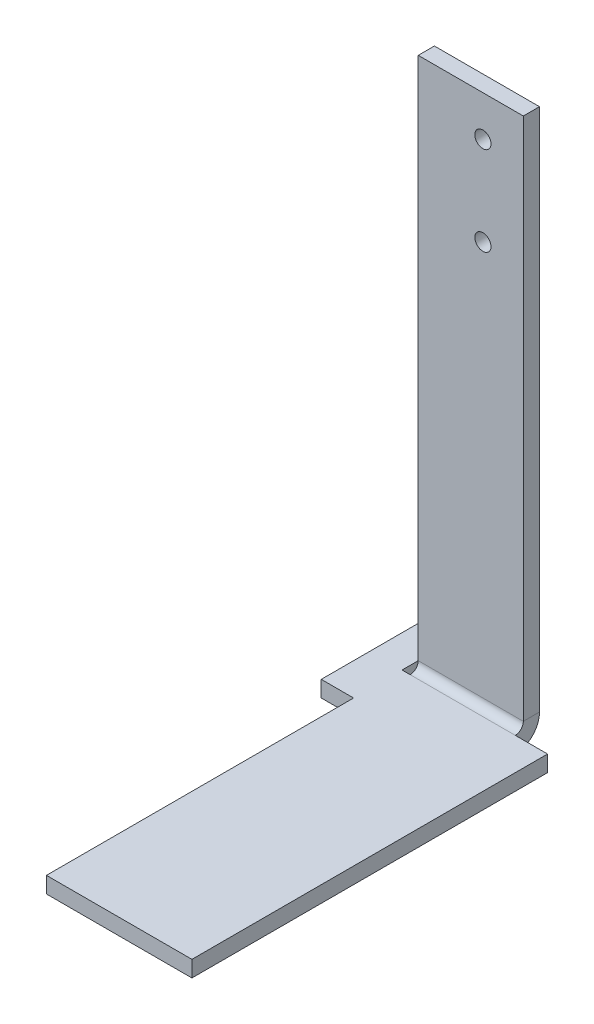
ISO-10303-21;
HEADER;
FILE_DESCRIPTION(('STEP AP214'),'2;1');
FILE_NAME('part.step','',(''),(''),'','','');
FILE_SCHEMA(('AUTOMOTIVE_DESIGN { 1 0 10303 214 1 1 1 1 }'));
ENDSEC;
DATA;
#1=APPLICATION_CONTEXT('core data for automotive mechanical design processes');
#2=APPLICATION_PROTOCOL_DEFINITION('international standard','automotive_design',2000,#1);
#3=PRODUCT_CONTEXT('',#1,'mechanical');
#4=PRODUCT('Part','Part','',(#3));
#5=PRODUCT_RELATED_PRODUCT_CATEGORY('part','',(#4));
#6=PRODUCT_DEFINITION_FORMATION('','',#4);
#7=PRODUCT_DEFINITION_CONTEXT('part definition',#1,'design');
#8=PRODUCT_DEFINITION('design','',#6,#7);
#9=PRODUCT_DEFINITION_SHAPE('','',#8);
#10=(LENGTH_UNIT() NAMED_UNIT(*) SI_UNIT(.MILLI.,.METRE.));
#11=(NAMED_UNIT(*) PLANE_ANGLE_UNIT() SI_UNIT($,.RADIAN.));
#12=(NAMED_UNIT(*) SI_UNIT($,.STERADIAN.) SOLID_ANGLE_UNIT());
#13=UNCERTAINTY_MEASURE_WITH_UNIT(LENGTH_MEASURE(1.E-05),#10,'distance_accuracy_value','');
#14=(GEOMETRIC_REPRESENTATION_CONTEXT(3) GLOBAL_UNCERTAINTY_ASSIGNED_CONTEXT((#13)) GLOBAL_UNIT_ASSIGNED_CONTEXT((#10,
#11,#12)) REPRESENTATION_CONTEXT('',''));
#15=CARTESIAN_POINT('',(0.,0.,0.));
#16=DIRECTION('',(0.,0.,1.));
#17=DIRECTION('',(1.,0.,0.));
#18=AXIS2_PLACEMENT_3D('',#15,#16,#17);
#19=CARTESIAN_POINT('',(0.,-23.0707963267949,-23.5000000000001));
#20=DIRECTION('',(0.,0.,1.));
#21=DIRECTION('',(0.,-1.,0.));
#22=AXIS2_PLACEMENT_3D('',#19,#20,#21);
#23=PLANE('',#22);
#24=CARTESIAN_POINT('',(4.49999999999999,24.9292036732051,-23.4999999999999));
#25=DIRECTION('',(0.,0.,-1.));
#26=DIRECTION('',(0.,1.,0.));
#27=AXIS2_PLACEMENT_3D('',#24,#25,#26);
#28=CIRCLE('',#27,0.500000000000002);
#29=CARTESIAN_POINT('',(4.49999999999999,25.4292036732051,-23.4999999999999));
#30=VERTEX_POINT('',#29);
#31=EDGE_CURVE('E279',#30,#30,#28,.T.);
#32=ORIENTED_EDGE('',*,*,#31,.F.);
#33=EDGE_LOOP('',(#32));
#34=FACE_BOUND('',#33,.T.);
#35=CARTESIAN_POINT('',(4.49999999999999,30.4292036732051,-23.4999999999999));
#36=DIRECTION('',(0.,0.,-1.));
#37=DIRECTION('',(0.,1.,0.));
#38=AXIS2_PLACEMENT_3D('',#35,#36,#37);
#39=CIRCLE('',#38,0.500000000000002);
#40=CARTESIAN_POINT('',(4.49999999999999,30.9292036732051,-23.4999999999999));
#41=VERTEX_POINT('',#40);
#42=EDGE_CURVE('E202',#41,#41,#39,.T.);
#43=ORIENTED_EDGE('',*,*,#42,.F.);
#44=EDGE_LOOP('',(#43));
#45=FACE_BOUND('',#44,.T.);
#46=DIRECTION('',(0.,1.,0.));
#47=VECTOR('',#46,1.);
#48=CARTESIAN_POINT('',(7.,-1.07079632679489,-23.5));
#49=LINE('',#48,#47);
#50=CARTESIAN_POINT('',(7.,0.499999999999998,-23.5));
#51=VERTEX_POINT('',#50);
#52=CARTESIAN_POINT('',(7.,32.9292036732051,-23.4999999999999));
#53=VERTEX_POINT('',#52);
#54=EDGE_CURVE('E41',#51,#53,#49,.T.);
#55=ORIENTED_EDGE('',*,*,#54,.F.);
#56=DIRECTION('',(-1.,0.,0.));
#57=VECTOR('',#56,1.);
#58=CARTESIAN_POINT('',(0.,0.500000000000004,-23.5));
#59=LINE('',#58,#57);
#60=CARTESIAN_POINT('',(0.500000000000001,0.500000000000004,-23.5));
#61=VERTEX_POINT('',#60);
#62=EDGE_CURVE('E139',#51,#61,#59,.T.);
#63=ORIENTED_EDGE('',*,*,#62,.T.);
#64=DIRECTION('',(0.,-1.,0.));
#65=VECTOR('',#64,1.);
#66=CARTESIAN_POINT('',(0.5,4.92920367320513,-23.5));
#67=LINE('',#66,#65);
#68=CARTESIAN_POINT('',(0.5,32.9292036732051,-23.4999999999999));
#69=VERTEX_POINT('',#68);
#70=EDGE_CURVE('E169',#69,#61,#67,.T.);
#71=ORIENTED_EDGE('',*,*,#70,.F.);
#72=DIRECTION('',(-1.,0.,0.));
#73=VECTOR('',#72,1.);
#74=CARTESIAN_POINT('',(-2.,32.9292036732051,-23.4999999999999));
#75=LINE('',#74,#73);
#76=EDGE_CURVE('E159',#53,#69,#75,.T.);
#77=ORIENTED_EDGE('',*,*,#76,.F.);
#78=EDGE_LOOP('',(#55,#63,#71,#77));
#79=FACE_BOUND('',#78,.T.);
#80=ADVANCED_FACE('F37',(#34,#45,#79),#23,.F.);
#81=CARTESIAN_POINT('',(-2.,32.9292036732051,-23.4999999999999));
#82=DIRECTION('',(0.,1.,0.));
#83=DIRECTION('',(-1.,0.,0.));
#84=AXIS2_PLACEMENT_3D('',#81,#82,#83);
#85=PLANE('',#84);
#86=ORIENTED_EDGE('',*,*,#76,.T.);
#87=DIRECTION('',(0.,0.,1.));
#88=VECTOR('',#87,1.);
#89=CARTESIAN_POINT('',(0.5,32.9292036732051,-23.4999999999999));
#90=LINE('',#89,#88);
#91=CARTESIAN_POINT('',(0.5,32.9292036732051,-22.4999999999999));
#92=VERTEX_POINT('',#91);
#93=EDGE_CURVE('E171',#69,#92,#90,.T.);
#94=ORIENTED_EDGE('',*,*,#93,.T.);
#95=DIRECTION('',(-1.,0.,0.));
#96=VECTOR('',#95,1.);
#97=CARTESIAN_POINT('',(-2.,32.9292036732051,-22.4999999999999));
#98=LINE('',#97,#96);
#99=CARTESIAN_POINT('',(7.,32.9292036732051,-22.4999999999999));
#100=VERTEX_POINT('',#99);
#101=EDGE_CURVE('E160',#100,#92,#98,.T.);
#102=ORIENTED_EDGE('',*,*,#101,.F.);
#103=DIRECTION('',(0.,0.,1.));
#104=VECTOR('',#103,1.);
#105=CARTESIAN_POINT('',(7.,32.9292036732051,-23.4999999999999));
#106=LINE('',#105,#104);
#107=EDGE_CURVE('E148',#53,#100,#106,.T.);
#108=ORIENTED_EDGE('',*,*,#107,.F.);
#109=EDGE_LOOP('',(#86,#94,#102,#108));
#110=FACE_BOUND('',#109,.T.);
#111=ADVANCED_FACE('F186',(#110),#85,.T.);
#112=CARTESIAN_POINT('',(0.,-23.0707963267949,-22.5000000000001));
#113=DIRECTION('',(0.,0.,1.));
#114=DIRECTION('',(0.,-1.,0.));
#115=AXIS2_PLACEMENT_3D('',#112,#113,#114);
#116=PLANE('',#115);
#117=CARTESIAN_POINT('',(4.49999999999999,24.9292036732051,-22.4999999999999));
#118=DIRECTION('',(0.,0.,1.));
#119=DIRECTION('',(0.,-1.,0.));
#120=AXIS2_PLACEMENT_3D('',#117,#118,#119);
#121=CIRCLE('',#120,0.500000000000002);
#122=CARTESIAN_POINT('',(4.49999999999999,24.4292036732051,-22.4999999999999));
#123=VERTEX_POINT('',#122);
#124=EDGE_CURVE('E282',#123,#123,#121,.F.);
#125=ORIENTED_EDGE('',*,*,#124,.T.);
#126=EDGE_LOOP('',(#125));
#127=FACE_BOUND('',#126,.T.);
#128=CARTESIAN_POINT('',(4.49999999999999,30.4292036732051,-22.4999999999999));
#129=DIRECTION('',(0.,0.,1.));
#130=DIRECTION('',(0.,-1.,0.));
#131=AXIS2_PLACEMENT_3D('',#128,#129,#130);
#132=CIRCLE('',#131,0.500000000000002);
#133=CARTESIAN_POINT('',(4.49999999999999,29.9292036732051,-22.4999999999999));
#134=VERTEX_POINT('',#133);
#135=EDGE_CURVE('E276',#134,#134,#132,.F.);
#136=ORIENTED_EDGE('',*,*,#135,.T.);
#137=EDGE_LOOP('',(#136));
#138=FACE_BOUND('',#137,.T.);
#139=DIRECTION('',(-1.,0.,0.));
#140=VECTOR('',#139,1.);
#141=CARTESIAN_POINT('',(0.,0.5,-22.5));
#142=LINE('',#141,#140);
#143=CARTESIAN_POINT('',(7.,0.499999999999997,-22.5));
#144=VERTEX_POINT('',#143);
#145=CARTESIAN_POINT('',(0.5,0.499999999999997,-22.5));
#146=VERTEX_POINT('',#145);
#147=EDGE_CURVE('E46',#144,#146,#142,.T.);
#148=ORIENTED_EDGE('',*,*,#147,.F.);
#149=DIRECTION('',(0.,1.,0.));
#150=VECTOR('',#149,1.);
#151=CARTESIAN_POINT('',(7.,-1.07079632679489,-22.5));
#152=LINE('',#151,#150);
#153=EDGE_CURVE('E163',#144,#100,#152,.T.);
#154=ORIENTED_EDGE('',*,*,#153,.T.);
#155=ORIENTED_EDGE('',*,*,#101,.T.);
#156=DIRECTION('',(0.,-1.,0.));
#157=VECTOR('',#156,1.);
#158=CARTESIAN_POINT('',(0.5,4.92920367320513,-22.5));
#159=LINE('',#158,#157);
#160=EDGE_CURVE('E172',#92,#146,#159,.T.);
#161=ORIENTED_EDGE('',*,*,#160,.T.);
#162=EDGE_LOOP('',(#148,#154,#155,#161));
#163=FACE_BOUND('',#162,.T.);
#164=ADVANCED_FACE('F187',(#127,#138,#163),#116,.T.);
#165=CARTESIAN_POINT('',(7.,-1.07079632679489,-23.5));
#166=DIRECTION('',(1.,0.,0.));
#167=DIRECTION('',(0.,1.,0.));
#168=AXIS2_PLACEMENT_3D('',#165,#166,#167);
#169=PLANE('',#168);
#170=DIRECTION('',(0.,0.,1.));
#171=VECTOR('',#170,1.);
#172=CARTESIAN_POINT('',(7.,0.500000000000004,-23.5));
#173=LINE('',#172,#171);
#174=EDGE_CURVE('E147',#51,#144,#173,.T.);
#175=ORIENTED_EDGE('',*,*,#174,.F.);
#176=ORIENTED_EDGE('',*,*,#54,.T.);
#177=ORIENTED_EDGE('',*,*,#107,.T.);
#178=ORIENTED_EDGE('',*,*,#153,.F.);
#179=EDGE_LOOP('',(#175,#176,#177,#178));
#180=FACE_BOUND('',#179,.T.);
#181=ADVANCED_FACE('F162',(#180),#169,.T.);
#182=CARTESIAN_POINT('',(0.5,4.92920367320513,-23.5));
#183=DIRECTION('',(-1.,0.,0.));
#184=DIRECTION('',(0.,-1.,0.));
#185=AXIS2_PLACEMENT_3D('',#182,#183,#184);
#186=PLANE('',#185);
#187=DIRECTION('',(0.,0.,-1.));
#188=VECTOR('',#187,1.);
#189=CARTESIAN_POINT('',(0.500000000000001,0.500000000000004,-23.5));
#190=LINE('',#189,#188);
#191=EDGE_CURVE('E12',#146,#61,#190,.T.);
#192=ORIENTED_EDGE('',*,*,#191,.F.);
#193=ORIENTED_EDGE('',*,*,#160,.F.);
#194=ORIENTED_EDGE('',*,*,#93,.F.);
#195=ORIENTED_EDGE('',*,*,#70,.T.);
#196=EDGE_LOOP('',(#192,#193,#194,#195));
#197=FACE_BOUND('',#196,.T.);
#198=ADVANCED_FACE('F39',(#197),#186,.T.);
#199=CARTESIAN_POINT('',(0.,-1.,-28.));
#200=DIRECTION('',(1.,0.,0.));
#201=DIRECTION('',(0.,0.,-1.));
#202=AXIS2_PLACEMENT_3D('',#199,#200,#201);
#203=PLANE('',#202);
#204=DIRECTION('',(0.,0.,-1.));
#205=VECTOR('',#204,1.);
#206=CARTESIAN_POINT('',(0.,0.,-28.));
#207=LINE('',#206,#205);
#208=CARTESIAN_POINT('',(0.,0.,-22.));
#209=VERTEX_POINT('',#208);
#210=CARTESIAN_POINT('',(0.,0.,-26.5));
#211=VERTEX_POINT('',#210);
#212=EDGE_CURVE('E226',#209,#211,#207,.T.);
#213=ORIENTED_EDGE('',*,*,#212,.F.);
#214=DIRECTION('',(0.,1.,0.));
#215=VECTOR('',#214,1.);
#216=CARTESIAN_POINT('',(0.,-1.,-22.));
#217=LINE('',#216,#215);
#218=CARTESIAN_POINT('',(0.,-1.,-22.));
#219=VERTEX_POINT('',#218);
#220=EDGE_CURVE('E174',#219,#209,#217,.T.);
#221=ORIENTED_EDGE('',*,*,#220,.F.);
#222=DIRECTION('',(0.,0.,-1.));
#223=VECTOR('',#222,1.);
#224=CARTESIAN_POINT('',(0.,-1.,-28.));
#225=LINE('',#224,#223);
#226=CARTESIAN_POINT('',(0.,-1.,-26.5));
#227=VERTEX_POINT('',#226);
#228=EDGE_CURVE('E274',#219,#227,#225,.T.);
#229=ORIENTED_EDGE('',*,*,#228,.T.);
#230=DIRECTION('',(0.,1.,0.));
#231=VECTOR('',#230,1.);
#232=CARTESIAN_POINT('',(0.,-1.,-26.5));
#233=LINE('',#232,#231);
#234=EDGE_CURVE('E271',#227,#211,#233,.T.);
#235=ORIENTED_EDGE('',*,*,#234,.T.);
#236=EDGE_LOOP('',(#213,#221,#229,#235));
#237=FACE_BOUND('',#236,.T.);
#238=ADVANCED_FACE('F316',(#237),#203,.T.);
#239=CARTESIAN_POINT('',(-41.0315666589957,-1.,-26.5000000000001));
#240=DIRECTION('',(0.,0.,-1.));
#241=DIRECTION('',(-1.,0.,0.));
#242=AXIS2_PLACEMENT_3D('',#239,#240,#241);
#243=PLANE('',#242);
#244=DIRECTION('',(-1.,0.,0.));
#245=VECTOR('',#244,1.);
#246=CARTESIAN_POINT('',(-41.0315666589957,0.,-26.5000000000001));
#247=LINE('',#246,#245);
#248=CARTESIAN_POINT('',(-1.99999999999999,0.,-26.5));
#249=VERTEX_POINT('',#248);
#250=EDGE_CURVE('E223',#211,#249,#247,.T.);
#251=ORIENTED_EDGE('',*,*,#250,.F.);
#252=ORIENTED_EDGE('',*,*,#234,.F.);
#253=DIRECTION('',(-1.,0.,0.));
#254=VECTOR('',#253,1.);
#255=CARTESIAN_POINT('',(-41.0315666589957,-1.,-26.5000000000001));
#256=LINE('',#255,#254);
#257=CARTESIAN_POINT('',(-1.99999999999999,-1.,-26.5));
#258=VERTEX_POINT('',#257);
#259=EDGE_CURVE('E269',#227,#258,#256,.T.);
#260=ORIENTED_EDGE('',*,*,#259,.T.);
#261=DIRECTION('',(0.,1.,0.));
#262=VECTOR('',#261,1.);
#263=CARTESIAN_POINT('',(-1.99999999999999,-1.,-26.5));
#264=LINE('',#263,#262);
#265=EDGE_CURVE('E267',#258,#249,#264,.T.);
#266=ORIENTED_EDGE('',*,*,#265,.T.);
#267=EDGE_LOOP('',(#251,#252,#260,#266));
#268=FACE_BOUND('',#267,.T.);
#269=ADVANCED_FACE('F319',(#268),#243,.T.);
#270=CARTESIAN_POINT('',(-2.,-1.,-56.));
#271=DIRECTION('',(-1.,0.,0.));
#272=DIRECTION('',(0.,0.,1.));
#273=AXIS2_PLACEMENT_3D('',#270,#271,#272);
#274=PLANE('',#273);
#275=DIRECTION('',(0.,0.,1.));
#276=VECTOR('',#275,1.);
#277=CARTESIAN_POINT('',(-2.,0.,-56.));
#278=LINE('',#277,#276);
#279=CARTESIAN_POINT('',(-1.99999999999999,0.,-19.));
#280=VERTEX_POINT('',#279);
#281=EDGE_CURVE('E221',#249,#280,#278,.T.);
#282=ORIENTED_EDGE('',*,*,#281,.F.);
#283=ORIENTED_EDGE('',*,*,#265,.F.);
#284=DIRECTION('',(0.,0.,1.));
#285=VECTOR('',#284,1.);
#286=CARTESIAN_POINT('',(-2.,-1.,-56.));
#287=LINE('',#286,#285);
#288=CARTESIAN_POINT('',(-1.99999999999999,-1.,-19.));
#289=VERTEX_POINT('',#288);
#290=EDGE_CURVE('E265',#258,#289,#287,.T.);
#291=ORIENTED_EDGE('',*,*,#290,.T.);
#292=DIRECTION('',(0.,1.,0.));
#293=VECTOR('',#292,1.);
#294=CARTESIAN_POINT('',(-1.99999999999999,-1.,-19.));
#295=LINE('',#294,#293);
#296=EDGE_CURVE('E262',#289,#280,#295,.T.);
#297=ORIENTED_EDGE('',*,*,#296,.T.);
#298=EDGE_LOOP('',(#282,#283,#291,#297));
#299=FACE_BOUND('',#298,.T.);
#300=ADVANCED_FACE('F323',(#299),#274,.T.);
#301=CARTESIAN_POINT('',(-1.99999999999999,-1.,-19.));
#302=DIRECTION('',(0.,0.,1.));
#303=DIRECTION('',(1.,0.,0.));
#304=AXIS2_PLACEMENT_3D('',#301,#302,#303);
#305=PLANE('',#304);
#306=DIRECTION('',(1.,0.,0.));
#307=VECTOR('',#306,1.);
#308=CARTESIAN_POINT('',(-1.99999999999999,0.,-19.));
#309=LINE('',#308,#307);
#310=CARTESIAN_POINT('',(0.,0.,-19.));
#311=VERTEX_POINT('',#310);
#312=EDGE_CURVE('E218',#280,#311,#309,.T.);
#313=ORIENTED_EDGE('',*,*,#312,.F.);
#314=ORIENTED_EDGE('',*,*,#296,.F.);
#315=DIRECTION('',(1.,0.,0.));
#316=VECTOR('',#315,1.);
#317=CARTESIAN_POINT('',(-1.99999999999999,-1.,-19.));
#318=LINE('',#317,#316);
#319=CARTESIAN_POINT('',(0.,-1.,-19.));
#320=VERTEX_POINT('',#319);
#321=EDGE_CURVE('E259',#289,#320,#318,.T.);
#322=ORIENTED_EDGE('',*,*,#321,.T.);
#323=DIRECTION('',(0.,1.,0.));
#324=VECTOR('',#323,1.);
#325=CARTESIAN_POINT('',(0.,-1.,-19.));
#326=LINE('',#325,#324);
#327=EDGE_CURVE('E257',#320,#311,#326,.T.);
#328=ORIENTED_EDGE('',*,*,#327,.T.);
#329=EDGE_LOOP('',(#313,#314,#322,#328));
#330=FACE_BOUND('',#329,.T.);
#331=ADVANCED_FACE('F327',(#330),#305,.T.);
#332=CARTESIAN_POINT('',(0.,-1.,-19.));
#333=DIRECTION('',(-1.,0.,0.));
#334=DIRECTION('',(0.,0.,1.));
#335=AXIS2_PLACEMENT_3D('',#332,#333,#334);
#336=PLANE('',#335);
#337=DIRECTION('',(0.,0.,1.));
#338=VECTOR('',#337,1.);
#339=CARTESIAN_POINT('',(0.,0.,-19.));
#340=LINE('',#339,#338);
#341=CARTESIAN_POINT('',(0.,0.,0.));
#342=VERTEX_POINT('',#341);
#343=EDGE_CURVE('E215',#311,#342,#340,.T.);
#344=ORIENTED_EDGE('',*,*,#343,.F.);
#345=ORIENTED_EDGE('',*,*,#327,.F.);
#346=DIRECTION('',(0.,0.,1.));
#347=VECTOR('',#346,1.);
#348=CARTESIAN_POINT('',(0.,-1.,-19.));
#349=LINE('',#348,#347);
#350=CARTESIAN_POINT('',(0.,-1.,0.));
#351=VERTEX_POINT('',#350);
#352=EDGE_CURVE('E254',#320,#351,#349,.T.);
#353=ORIENTED_EDGE('',*,*,#352,.T.);
#354=DIRECTION('',(0.,1.,0.));
#355=VECTOR('',#354,1.);
#356=CARTESIAN_POINT('',(0.,-1.,0.));
#357=LINE('',#356,#355);
#358=EDGE_CURVE('E252',#351,#342,#357,.T.);
#359=ORIENTED_EDGE('',*,*,#358,.T.);
#360=EDGE_LOOP('',(#344,#345,#353,#359));
#361=FACE_BOUND('',#360,.T.);
#362=ADVANCED_FACE('F331',(#361),#336,.T.);
#363=CARTESIAN_POINT('',(0.,-1.,0.));
#364=DIRECTION('',(0.,0.,1.));
#365=DIRECTION('',(1.,0.,0.));
#366=AXIS2_PLACEMENT_3D('',#363,#364,#365);
#367=PLANE('',#366);
#368=DIRECTION('',(1.,0.,0.));
#369=VECTOR('',#368,1.);
#370=CARTESIAN_POINT('',(0.,0.,0.));
#371=LINE('',#370,#369);
#372=CARTESIAN_POINT('',(9.,0.,0.));
#373=VERTEX_POINT('',#372);
#374=EDGE_CURVE('E212',#342,#373,#371,.T.);
#375=ORIENTED_EDGE('',*,*,#374,.F.);
#376=ORIENTED_EDGE('',*,*,#358,.F.);
#377=DIRECTION('',(1.,0.,0.));
#378=VECTOR('',#377,1.);
#379=CARTESIAN_POINT('',(0.,-1.,0.));
#380=LINE('',#379,#378);
#381=CARTESIAN_POINT('',(9.,-1.,0.));
#382=VERTEX_POINT('',#381);
#383=EDGE_CURVE('E249',#351,#382,#380,.T.);
#384=ORIENTED_EDGE('',*,*,#383,.T.);
#385=DIRECTION('',(0.,1.,0.));
#386=VECTOR('',#385,1.);
#387=CARTESIAN_POINT('',(9.,-1.,0.));
#388=LINE('',#387,#386);
#389=EDGE_CURVE('E247',#382,#373,#388,.T.);
#390=ORIENTED_EDGE('',*,*,#389,.T.);
#391=EDGE_LOOP('',(#375,#376,#384,#390));
#392=FACE_BOUND('',#391,.T.);
#393=ADVANCED_FACE('F335',(#392),#367,.T.);
#394=CARTESIAN_POINT('',(9.,-1.,0.));
#395=DIRECTION('',(1.,0.,0.));
#396=DIRECTION('',(0.,0.,-1.));
#397=AXIS2_PLACEMENT_3D('',#394,#395,#396);
#398=PLANE('',#397);
#399=DIRECTION('',(0.,0.,-1.));
#400=VECTOR('',#399,1.);
#401=CARTESIAN_POINT('',(9.,0.,0.));
#402=LINE('',#401,#400);
#403=CARTESIAN_POINT('',(9.,0.,-22.));
#404=VERTEX_POINT('',#403);
#405=EDGE_CURVE('E209',#373,#404,#402,.T.);
#406=ORIENTED_EDGE('',*,*,#405,.F.);
#407=ORIENTED_EDGE('',*,*,#389,.F.);
#408=DIRECTION('',(0.,0.,-1.));
#409=VECTOR('',#408,1.);
#410=CARTESIAN_POINT('',(9.,-1.,0.));
#411=LINE('',#410,#409);
#412=CARTESIAN_POINT('',(9.,-1.,-22.));
#413=VERTEX_POINT('',#412);
#414=EDGE_CURVE('E244',#382,#413,#411,.T.);
#415=ORIENTED_EDGE('',*,*,#414,.T.);
#416=DIRECTION('',(0.,1.,0.));
#417=VECTOR('',#416,1.);
#418=CARTESIAN_POINT('',(9.,-1.,-22.));
#419=LINE('',#418,#417);
#420=EDGE_CURVE('E242',#413,#404,#419,.T.);
#421=ORIENTED_EDGE('',*,*,#420,.T.);
#422=EDGE_LOOP('',(#406,#407,#415,#421));
#423=FACE_BOUND('',#422,.T.);
#424=ADVANCED_FACE('F339',(#423),#398,.T.);
#425=CARTESIAN_POINT('',(0.,-1.,0.));
#426=DIRECTION('',(0.,1.,0.));
#427=DIRECTION('',(0.,0.,1.));
#428=AXIS2_PLACEMENT_3D('',#425,#426,#427);
#429=PLANE('',#428);
#430=DIRECTION('',(-1.,0.,0.));
#431=VECTOR('',#430,1.);
#432=CARTESIAN_POINT('',(0.,-1.,-22.));
#433=LINE('',#432,#431);
#434=CARTESIAN_POINT('',(7.,-1.,-22.));
#435=VERTEX_POINT('',#434);
#436=CARTESIAN_POINT('',(0.5,-1.,-22.));
#437=VERTEX_POINT('',#436);
#438=EDGE_CURVE('E184',#435,#437,#433,.T.);
#439=ORIENTED_EDGE('',*,*,#438,.F.);
#440=DIRECTION('',(-1.,0.,0.));
#441=VECTOR('',#440,1.);
#442=CARTESIAN_POINT('',(9.,-1.,-22.));
#443=LINE('',#442,#441);
#444=EDGE_CURVE('E239',#413,#435,#443,.T.);
#445=ORIENTED_EDGE('',*,*,#444,.F.);
#446=ORIENTED_EDGE('',*,*,#414,.F.);
#447=ORIENTED_EDGE('',*,*,#383,.F.);
#448=ORIENTED_EDGE('',*,*,#352,.F.);
#449=ORIENTED_EDGE('',*,*,#321,.F.);
#450=ORIENTED_EDGE('',*,*,#290,.F.);
#451=ORIENTED_EDGE('',*,*,#259,.F.);
#452=ORIENTED_EDGE('',*,*,#228,.F.);
#453=DIRECTION('',(-1.,0.,0.));
#454=VECTOR('',#453,1.);
#455=CARTESIAN_POINT('',(-41.0315666589957,-1.,-22.));
#456=LINE('',#455,#454);
#457=EDGE_CURVE('E207',#437,#219,#456,.T.);
#458=ORIENTED_EDGE('',*,*,#457,.F.);
#459=EDGE_LOOP('',(#439,#445,#446,#447,#448,#449,#450,#451,#452,#458));
#460=FACE_BOUND('',#459,.T.);
#461=ADVANCED_FACE('F343',(#460),#429,.F.);
#462=CARTESIAN_POINT('',(9.,-1.,-22.));
#463=DIRECTION('',(0.,0.,-1.));
#464=DIRECTION('',(-1.,0.,0.));
#465=AXIS2_PLACEMENT_3D('',#462,#463,#464);
#466=PLANE('',#465);
#467=DIRECTION('',(-1.,0.,0.));
#468=VECTOR('',#467,1.);
#469=CARTESIAN_POINT('',(9.,0.,-22.));
#470=LINE('',#469,#468);
#471=CARTESIAN_POINT('',(7.,0.,-22.));
#472=VERTEX_POINT('',#471);
#473=EDGE_CURVE('E235',#404,#472,#470,.T.);
#474=ORIENTED_EDGE('',*,*,#473,.F.);
#475=ORIENTED_EDGE('',*,*,#420,.F.);
#476=ORIENTED_EDGE('',*,*,#444,.T.);
#477=DIRECTION('',(0.,1.,0.));
#478=VECTOR('',#477,1.);
#479=CARTESIAN_POINT('',(7.,-1.,-22.));
#480=LINE('',#479,#478);
#481=EDGE_CURVE('E154',#435,#472,#480,.T.);
#482=ORIENTED_EDGE('',*,*,#481,.T.);
#483=EDGE_LOOP('',(#474,#475,#476,#482));
#484=FACE_BOUND('',#483,.T.);
#485=ADVANCED_FACE('F347',(#484),#466,.T.);
#486=CARTESIAN_POINT('',(0.,0.,0.));
#487=DIRECTION('',(0.,1.,0.));
#488=DIRECTION('',(0.,0.,1.));
#489=AXIS2_PLACEMENT_3D('',#486,#487,#488);
#490=PLANE('',#489);
#491=ORIENTED_EDGE('',*,*,#473,.T.);
#492=DIRECTION('',(-1.,0.,0.));
#493=VECTOR('',#492,1.);
#494=CARTESIAN_POINT('',(0.,0.,-22.));
#495=LINE('',#494,#493);
#496=CARTESIAN_POINT('',(0.5,0.,-22.));
#497=VERTEX_POINT('',#496);
#498=EDGE_CURVE('E232',#472,#497,#495,.T.);
#499=ORIENTED_EDGE('',*,*,#498,.T.);
#500=DIRECTION('',(-1.,0.,0.));
#501=VECTOR('',#500,1.);
#502=CARTESIAN_POINT('',(-41.0315666589957,0.,-22.));
#503=LINE('',#502,#501);
#504=EDGE_CURVE('E229',#497,#209,#503,.T.);
#505=ORIENTED_EDGE('',*,*,#504,.T.);
#506=ORIENTED_EDGE('',*,*,#212,.T.);
#507=ORIENTED_EDGE('',*,*,#250,.T.);
#508=ORIENTED_EDGE('',*,*,#281,.T.);
#509=ORIENTED_EDGE('',*,*,#312,.T.);
#510=ORIENTED_EDGE('',*,*,#343,.T.);
#511=ORIENTED_EDGE('',*,*,#374,.T.);
#512=ORIENTED_EDGE('',*,*,#405,.T.);
#513=EDGE_LOOP('',(#491,#499,#505,#506,#507,#508,#509,#510,#511,#512));
#514=FACE_BOUND('',#513,.T.);
#515=ADVANCED_FACE('F351',(#514),#490,.T.);
#516=CARTESIAN_POINT('',(-41.0315666589957,-1.,-22.));
#517=DIRECTION('',(0.,0.,-1.));
#518=DIRECTION('',(-1.,0.,0.));
#519=AXIS2_PLACEMENT_3D('',#516,#517,#518);
#520=PLANE('',#519);
#521=ORIENTED_EDGE('',*,*,#504,.F.);
#522=DIRECTION('',(0.,1.,0.));
#523=VECTOR('',#522,1.);
#524=CARTESIAN_POINT('',(0.500000000000001,-1.,-22.));
#525=LINE('',#524,#523);
#526=EDGE_CURVE('E196',#437,#497,#525,.T.);
#527=ORIENTED_EDGE('',*,*,#526,.F.);
#528=ORIENTED_EDGE('',*,*,#457,.T.);
#529=ORIENTED_EDGE('',*,*,#220,.T.);
#530=EDGE_LOOP('',(#521,#527,#528,#529));
#531=FACE_BOUND('',#530,.T.);
#532=ADVANCED_FACE('F313',(#531),#520,.T.);
#533=CARTESIAN_POINT('',(7.,0.499999999999997,-22.));
#534=DIRECTION('',(1.,0.,0.));
#535=DIRECTION('',(0.,0.,-1.));
#536=AXIS2_PLACEMENT_3D('',#533,#534,#535);
#537=PLANE('',#536);
#538=ORIENTED_EDGE('',*,*,#174,.T.);
#539=CARTESIAN_POINT('',(7.,0.499999999999997,-22.));
#540=DIRECTION('',(1.,0.,0.));
#541=DIRECTION('',(0.,0.,-1.));
#542=AXIS2_PLACEMENT_3D('',#539,#540,#541);
#543=CIRCLE('',#542,0.499999999999997);
#544=EDGE_CURVE('E200',#144,#472,#543,.F.);
#545=ORIENTED_EDGE('',*,*,#544,.T.);
#546=ORIENTED_EDGE('',*,*,#481,.F.);
#547=CARTESIAN_POINT('',(7.,0.499999999999997,-22.));
#548=DIRECTION('',(-1.,0.,0.));
#549=DIRECTION('',(0.,0.,-1.));
#550=AXIS2_PLACEMENT_3D('',#547,#548,#549);
#551=CIRCLE('',#550,1.5);
#552=EDGE_CURVE('E142',#51,#435,#551,.T.);
#553=ORIENTED_EDGE('',*,*,#552,.F.);
#554=EDGE_LOOP('',(#538,#545,#546,#553));
#555=FACE_BOUND('',#554,.T.);
#556=ADVANCED_FACE('F151',(#555),#537,.T.);
#557=CARTESIAN_POINT('',(0.5,0.499999999999997,-22.));
#558=DIRECTION('',(-1.,0.,0.));
#559=DIRECTION('',(0.,0.,1.));
#560=AXIS2_PLACEMENT_3D('',#557,#558,#559);
#561=PLANE('',#560);
#562=CARTESIAN_POINT('',(0.5,0.499999999999997,-22.));
#563=DIRECTION('',(1.,0.,0.));
#564=DIRECTION('',(0.,0.,-1.));
#565=AXIS2_PLACEMENT_3D('',#562,#563,#564);
#566=CIRCLE('',#565,0.499999999999997);
#567=EDGE_CURVE('E155',#497,#146,#566,.T.);
#568=ORIENTED_EDGE('',*,*,#567,.T.);
#569=ORIENTED_EDGE('',*,*,#191,.T.);
#570=CARTESIAN_POINT('',(0.5,0.499999999999997,-22.));
#571=DIRECTION('',(1.,0.,0.));
#572=DIRECTION('',(0.,0.,1.));
#573=AXIS2_PLACEMENT_3D('',#570,#571,#572);
#574=CIRCLE('',#573,1.5);
#575=EDGE_CURVE('E54',#437,#61,#574,.T.);
#576=ORIENTED_EDGE('',*,*,#575,.F.);
#577=ORIENTED_EDGE('',*,*,#526,.T.);
#578=EDGE_LOOP('',(#568,#569,#576,#577));
#579=FACE_BOUND('',#578,.T.);
#580=ADVANCED_FACE('F192',(#579),#561,.T.);
#581=CARTESIAN_POINT('',(-3.01146441980377,0.499999999999997,-22.));
#582=DIRECTION('',(1.,0.,0.));
#583=DIRECTION('',(0.,0.,-1.));
#584=AXIS2_PLACEMENT_3D('',#581,#582,#583);
#585=CYLINDRICAL_SURFACE('',#584,1.5);
#586=ORIENTED_EDGE('',*,*,#438,.T.);
#587=ORIENTED_EDGE('',*,*,#575,.T.);
#588=ORIENTED_EDGE('',*,*,#62,.F.);
#589=ORIENTED_EDGE('',*,*,#552,.T.);
#590=EDGE_LOOP('',(#586,#587,#588,#589));
#591=FACE_BOUND('',#590,.T.);
#592=ADVANCED_FACE('F141',(#591),#585,.T.);
#593=CARTESIAN_POINT('',(-3.01146441980377,0.499999999999997,-22.));
#594=DIRECTION('',(1.,0.,0.));
#595=DIRECTION('',(0.,0.,-1.));
#596=AXIS2_PLACEMENT_3D('',#593,#594,#595);
#597=CYLINDRICAL_SURFACE('',#596,0.499999999999997);
#598=ORIENTED_EDGE('',*,*,#498,.F.);
#599=ORIENTED_EDGE('',*,*,#544,.F.);
#600=ORIENTED_EDGE('',*,*,#147,.T.);
#601=ORIENTED_EDGE('',*,*,#567,.F.);
#602=EDGE_LOOP('',(#598,#599,#600,#601));
#603=FACE_BOUND('',#602,.T.);
#604=ADVANCED_FACE('F297',(#603),#597,.F.);
#605=CARTESIAN_POINT('',(4.49999999999999,30.4292036732051,0.00100000000010855));
#606=DIRECTION('',(0.,0.,-1.));
#607=DIRECTION('',(0.,1.,0.));
#608=AXIS2_PLACEMENT_3D('',#605,#606,#607);
#609=CYLINDRICAL_SURFACE('',#608,0.500000000000002);
#610=ORIENTED_EDGE('',*,*,#135,.F.);
#611=EDGE_LOOP('',(#610));
#612=FACE_BOUND('',#611,.T.);
#613=ORIENTED_EDGE('',*,*,#42,.T.);
#614=EDGE_LOOP('',(#613));
#615=FACE_BOUND('',#614,.T.);
#616=ADVANCED_FACE('F295',(#612,#615),#609,.F.);
#617=CARTESIAN_POINT('',(4.49999999999999,24.9292036732051,0.00100000000008774));
#618=DIRECTION('',(0.,0.,-1.));
#619=DIRECTION('',(0.,1.,0.));
#620=AXIS2_PLACEMENT_3D('',#617,#618,#619);
#621=CYLINDRICAL_SURFACE('',#620,0.500000000000002);
#622=ORIENTED_EDGE('',*,*,#124,.F.);
#623=EDGE_LOOP('',(#622));
#624=FACE_BOUND('',#623,.T.);
#625=ORIENTED_EDGE('',*,*,#31,.T.);
#626=EDGE_LOOP('',(#625));
#627=FACE_BOUND('',#626,.T.);
#628=ADVANCED_FACE('F288',(#624,#627),#621,.F.);
#629=CLOSED_SHELL('',(#80,#111,#164,#181,#198,#238,#269,#300,#331,#362,#393,#424,#461,#485,#515,
#532,#556,#580,#592,#604,#616,#628));
#630=MANIFOLD_SOLID_BREP('B2',#629);
#631=ADVANCED_BREP_SHAPE_REPRESENTATION('',(#18,#630),#14);
#632=SHAPE_DEFINITION_REPRESENTATION(#9,#631);
ENDSEC;
END-ISO-10303-21;
